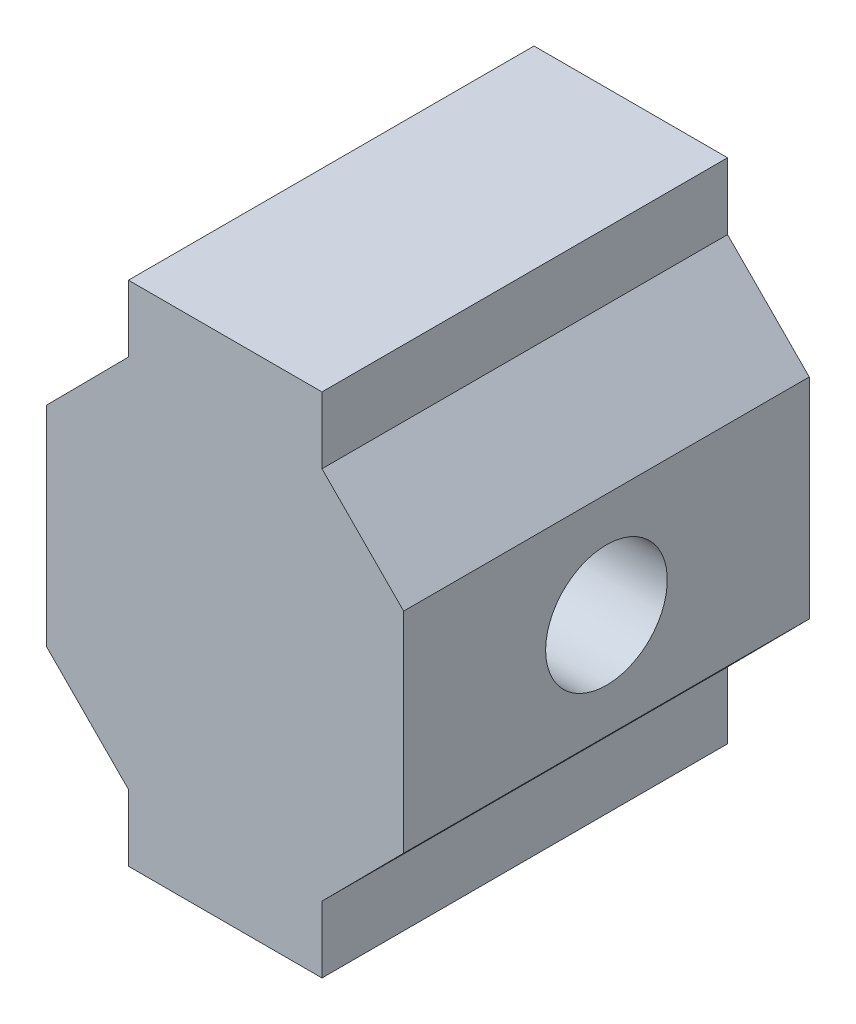
ISO-10303-21;
HEADER;
FILE_DESCRIPTION(('STEP AP214'),'2;1');
FILE_NAME('part.step','',(''),(''),'','','');
FILE_SCHEMA(('AUTOMOTIVE_DESIGN { 1 0 10303 214 1 1 1 1 }'));
ENDSEC;
DATA;
#1=APPLICATION_CONTEXT('core data for automotive mechanical design processes');
#2=APPLICATION_PROTOCOL_DEFINITION('international standard','automotive_design',2000,#1);
#3=PRODUCT_CONTEXT('',#1,'mechanical');
#4=PRODUCT('Part','Part','',(#3));
#5=PRODUCT_RELATED_PRODUCT_CATEGORY('part','',(#4));
#6=PRODUCT_DEFINITION_FORMATION('','',#4);
#7=PRODUCT_DEFINITION_CONTEXT('part definition',#1,'design');
#8=PRODUCT_DEFINITION('design','',#6,#7);
#9=PRODUCT_DEFINITION_SHAPE('','',#8);
#10=(LENGTH_UNIT() NAMED_UNIT(*) SI_UNIT(.MILLI.,.METRE.));
#11=(NAMED_UNIT(*) PLANE_ANGLE_UNIT() SI_UNIT($,.RADIAN.));
#12=(NAMED_UNIT(*) SI_UNIT($,.STERADIAN.) SOLID_ANGLE_UNIT());
#13=UNCERTAINTY_MEASURE_WITH_UNIT(LENGTH_MEASURE(1.E-05),#10,'distance_accuracy_value','');
#14=(GEOMETRIC_REPRESENTATION_CONTEXT(3) GLOBAL_UNCERTAINTY_ASSIGNED_CONTEXT((#13)) GLOBAL_UNIT_ASSIGNED_CONTEXT((#10,
#11,#12)) REPRESENTATION_CONTEXT('',''));
#15=CARTESIAN_POINT('',(0.,0.,0.));
#16=DIRECTION('',(0.,0.,1.));
#17=DIRECTION('',(1.,0.,0.));
#18=AXIS2_PLACEMENT_3D('',#15,#16,#17);
#19=CARTESIAN_POINT('',(4.772,-12.514,20.));
#20=DIRECTION('',(0.,1.,0.));
#21=DIRECTION('',(0.,0.,1.));
#22=AXIS2_PLACEMENT_3D('',#19,#20,#21);
#23=PLANE('',#22);
#24=DIRECTION('',(1.,0.,0.));
#25=VECTOR('',#24,1.);
#26=CARTESIAN_POINT('',(4.772,-12.514,0.));
#27=LINE('',#26,#25);
#28=CARTESIAN_POINT('',(-4.772,-12.514,0.));
#29=VERTEX_POINT('',#28);
#30=CARTESIAN_POINT('',(4.772,-12.514,0.));
#31=VERTEX_POINT('',#30);
#32=EDGE_CURVE('E157',#29,#31,#27,.T.);
#33=ORIENTED_EDGE('',*,*,#32,.T.);
#34=DIRECTION('',(0.,0.,-1.));
#35=VECTOR('',#34,1.);
#36=CARTESIAN_POINT('',(4.772,-12.514,20.));
#37=LINE('',#36,#35);
#38=CARTESIAN_POINT('',(4.772,-12.514,20.));
#39=VERTEX_POINT('',#38);
#40=EDGE_CURVE('E11',#39,#31,#37,.T.);
#41=ORIENTED_EDGE('',*,*,#40,.F.);
#42=DIRECTION('',(1.,0.,0.));
#43=VECTOR('',#42,1.);
#44=CARTESIAN_POINT('',(4.772,-12.514,20.));
#45=LINE('',#44,#43);
#46=CARTESIAN_POINT('',(-4.772,-12.514,20.));
#47=VERTEX_POINT('',#46);
#48=EDGE_CURVE('E182',#47,#39,#45,.T.);
#49=ORIENTED_EDGE('',*,*,#48,.F.);
#50=DIRECTION('',(0.,0.,-1.));
#51=VECTOR('',#50,1.);
#52=CARTESIAN_POINT('',(-4.772,-12.514,20.));
#53=LINE('',#52,#51);
#54=EDGE_CURVE('E153',#47,#29,#53,.T.);
#55=ORIENTED_EDGE('',*,*,#54,.T.);
#56=EDGE_LOOP('',(#33,#41,#49,#55));
#57=FACE_BOUND('',#56,.T.);
#58=ADVANCED_FACE('F37',(#57),#23,.F.);
#59=CARTESIAN_POINT('',(4.772,-12.514,20.));
#60=DIRECTION('',(-1.,0.,0.));
#61=DIRECTION('',(0.,0.,1.));
#62=AXIS2_PLACEMENT_3D('',#59,#60,#61);
#63=PLANE('',#62);
#64=DIRECTION('',(0.,1.,0.));
#65=VECTOR('',#64,1.);
#66=CARTESIAN_POINT('',(4.772,-12.514,0.));
#67=LINE('',#66,#65);
#68=CARTESIAN_POINT('',(4.772,-9.23167801898961,0.));
#69=VERTEX_POINT('',#68);
#70=EDGE_CURVE('E160',#31,#69,#67,.T.);
#71=ORIENTED_EDGE('',*,*,#70,.T.);
#72=DIRECTION('',(0.,0.,-1.));
#73=VECTOR('',#72,1.);
#74=CARTESIAN_POINT('',(4.772,-9.23167801898961,20.));
#75=LINE('',#74,#73);
#76=CARTESIAN_POINT('',(4.772,-9.23167801898961,20.));
#77=VERTEX_POINT('',#76);
#78=EDGE_CURVE('E46',#77,#69,#75,.T.);
#79=ORIENTED_EDGE('',*,*,#78,.F.);
#80=DIRECTION('',(0.,1.,0.));
#81=VECTOR('',#80,1.);
#82=CARTESIAN_POINT('',(4.772,-12.514,20.));
#83=LINE('',#82,#81);
#84=EDGE_CURVE('E109',#39,#77,#83,.T.);
#85=ORIENTED_EDGE('',*,*,#84,.F.);
#86=ORIENTED_EDGE('',*,*,#40,.T.);
#87=EDGE_LOOP('',(#71,#79,#85,#86));
#88=FACE_BOUND('',#87,.T.);
#89=ADVANCED_FACE('F261',(#88),#63,.F.);
#90=CARTESIAN_POINT('',(4.772,-9.23167801898961,20.));
#91=DIRECTION('',(-0.710245556345468,0.70395401106288,0.));
#92=DIRECTION('',(-0.70395401106288,-0.710245556345468,0.));
#93=AXIS2_PLACEMENT_3D('',#90,#91,#92);
#94=PLANE('',#93);
#95=DIRECTION('',(0.70395401106288,0.710245556345468,0.));
#96=VECTOR('',#95,1.);
#97=CARTESIAN_POINT('',(4.772,-9.23167801898961,0.));
#98=LINE('',#97,#96);
#99=CARTESIAN_POINT('',(8.8,-5.16767801898961,0.));
#100=VERTEX_POINT('',#99);
#101=EDGE_CURVE('E163',#69,#100,#98,.T.);
#102=ORIENTED_EDGE('',*,*,#101,.T.);
#103=DIRECTION('',(0.,0.,-1.));
#104=VECTOR('',#103,1.);
#105=CARTESIAN_POINT('',(8.8,-5.16767801898961,20.));
#106=LINE('',#105,#104);
#107=CARTESIAN_POINT('',(8.8,-5.16767801898961,20.));
#108=VERTEX_POINT('',#107);
#109=EDGE_CURVE('E201',#108,#100,#106,.T.);
#110=ORIENTED_EDGE('',*,*,#109,.F.);
#111=DIRECTION('',(0.70395401106288,0.710245556345468,0.));
#112=VECTOR('',#111,1.);
#113=CARTESIAN_POINT('',(4.772,-9.23167801898961,20.));
#114=LINE('',#113,#112);
#115=EDGE_CURVE('E210',#77,#108,#114,.T.);
#116=ORIENTED_EDGE('',*,*,#115,.F.);
#117=ORIENTED_EDGE('',*,*,#78,.T.);
#118=EDGE_LOOP('',(#102,#110,#116,#117));
#119=FACE_BOUND('',#118,.T.);
#120=ADVANCED_FACE('F208',(#119),#94,.F.);
#121=CARTESIAN_POINT('',(8.8,0.,20.));
#122=DIRECTION('',(-1.,0.,0.));
#123=DIRECTION('',(0.,0.,1.));
#124=AXIS2_PLACEMENT_3D('',#121,#122,#123);
#125=PLANE('',#124);
#126=CARTESIAN_POINT('',(8.8,0.,10.));
#127=DIRECTION('',(-1.,0.,0.));
#128=DIRECTION('',(0.,0.,1.));
#129=AXIS2_PLACEMENT_3D('',#126,#127,#128);
#130=CIRCLE('',#129,3.);
#131=CARTESIAN_POINT('',(8.8,0.,13.));
#132=VERTEX_POINT('',#131);
#133=EDGE_CURVE('E161',#132,#132,#130,.F.);
#134=ORIENTED_EDGE('',*,*,#133,.F.);
#135=EDGE_LOOP('',(#134));
#136=FACE_BOUND('',#135,.T.);
#137=DIRECTION('',(0.,1.,0.));
#138=VECTOR('',#137,1.);
#139=CARTESIAN_POINT('',(8.8,0.,0.));
#140=LINE('',#139,#138);
#141=CARTESIAN_POINT('',(8.8,5.16767801898961,0.));
#142=VERTEX_POINT('',#141);
#143=EDGE_CURVE('E166',#100,#142,#140,.T.);
#144=ORIENTED_EDGE('',*,*,#143,.T.);
#145=DIRECTION('',(0.,0.,-1.));
#146=VECTOR('',#145,1.);
#147=CARTESIAN_POINT('',(8.8,5.16767801898961,20.));
#148=LINE('',#147,#146);
#149=CARTESIAN_POINT('',(8.8,5.16767801898961,20.));
#150=VERTEX_POINT('',#149);
#151=EDGE_CURVE('E198',#150,#142,#148,.T.);
#152=ORIENTED_EDGE('',*,*,#151,.F.);
#153=DIRECTION('',(0.,1.,0.));
#154=VECTOR('',#153,1.);
#155=CARTESIAN_POINT('',(8.8,0.,20.));
#156=LINE('',#155,#154);
#157=EDGE_CURVE('E227',#108,#150,#156,.T.);
#158=ORIENTED_EDGE('',*,*,#157,.F.);
#159=ORIENTED_EDGE('',*,*,#109,.T.);
#160=EDGE_LOOP('',(#144,#152,#158,#159));
#161=FACE_BOUND('',#160,.T.);
#162=ADVANCED_FACE('F218',(#136,#161),#125,.F.);
#163=CARTESIAN_POINT('',(4.772,9.23167801898962,20.));
#164=DIRECTION('',(-0.710245556345468,-0.703954011062879,0.));
#165=DIRECTION('',(0.703954011062879,-0.710245556345468,0.));
#166=AXIS2_PLACEMENT_3D('',#163,#164,#165);
#167=PLANE('',#166);
#168=DIRECTION('',(-0.703954011062879,0.710245556345468,0.));
#169=VECTOR('',#168,1.);
#170=CARTESIAN_POINT('',(4.772,9.23167801898962,0.));
#171=LINE('',#170,#169);
#172=CARTESIAN_POINT('',(4.772,9.23167801898962,0.));
#173=VERTEX_POINT('',#172);
#174=EDGE_CURVE('E168',#142,#173,#171,.T.);
#175=ORIENTED_EDGE('',*,*,#174,.T.);
#176=DIRECTION('',(0.,0.,-1.));
#177=VECTOR('',#176,1.);
#178=CARTESIAN_POINT('',(4.772,9.23167801898962,20.));
#179=LINE('',#178,#177);
#180=CARTESIAN_POINT('',(4.772,9.23167801898962,20.));
#181=VERTEX_POINT('',#180);
#182=EDGE_CURVE('E195',#181,#173,#179,.T.);
#183=ORIENTED_EDGE('',*,*,#182,.F.);
#184=DIRECTION('',(-0.703954011062879,0.710245556345468,0.));
#185=VECTOR('',#184,1.);
#186=CARTESIAN_POINT('',(4.772,9.23167801898962,20.));
#187=LINE('',#186,#185);
#188=EDGE_CURVE('E224',#150,#181,#187,.T.);
#189=ORIENTED_EDGE('',*,*,#188,.F.);
#190=ORIENTED_EDGE('',*,*,#151,.T.);
#191=EDGE_LOOP('',(#175,#183,#189,#190));
#192=FACE_BOUND('',#191,.T.);
#193=ADVANCED_FACE('F222',(#192),#167,.F.);
#194=CARTESIAN_POINT('',(4.772,12.514,20.));
#195=DIRECTION('',(-1.,0.,0.));
#196=DIRECTION('',(0.,0.,1.));
#197=AXIS2_PLACEMENT_3D('',#194,#195,#196);
#198=PLANE('',#197);
#199=DIRECTION('',(0.,1.,0.));
#200=VECTOR('',#199,1.);
#201=CARTESIAN_POINT('',(4.772,12.514,0.));
#202=LINE('',#201,#200);
#203=CARTESIAN_POINT('',(4.772,12.514,0.));
#204=VERTEX_POINT('',#203);
#205=EDGE_CURVE('E170',#173,#204,#202,.T.);
#206=ORIENTED_EDGE('',*,*,#205,.T.);
#207=DIRECTION('',(0.,0.,-1.));
#208=VECTOR('',#207,1.);
#209=CARTESIAN_POINT('',(4.772,12.514,20.));
#210=LINE('',#209,#208);
#211=CARTESIAN_POINT('',(4.772,12.514,20.));
#212=VERTEX_POINT('',#211);
#213=EDGE_CURVE('E192',#212,#204,#210,.T.);
#214=ORIENTED_EDGE('',*,*,#213,.F.);
#215=DIRECTION('',(0.,1.,0.));
#216=VECTOR('',#215,1.);
#217=CARTESIAN_POINT('',(4.772,12.514,20.));
#218=LINE('',#217,#216);
#219=EDGE_CURVE('E226',#181,#212,#218,.T.);
#220=ORIENTED_EDGE('',*,*,#219,.F.);
#221=ORIENTED_EDGE('',*,*,#182,.T.);
#222=EDGE_LOOP('',(#206,#214,#220,#221));
#223=FACE_BOUND('',#222,.T.);
#224=ADVANCED_FACE('F275',(#223),#198,.F.);
#225=CARTESIAN_POINT('',(4.772,12.514,20.));
#226=DIRECTION('',(0.,-1.,0.));
#227=DIRECTION('',(0.,0.,-1.));
#228=AXIS2_PLACEMENT_3D('',#225,#226,#227);
#229=PLANE('',#228);
#230=DIRECTION('',(-1.,0.,0.));
#231=VECTOR('',#230,1.);
#232=CARTESIAN_POINT('',(4.772,12.514,0.));
#233=LINE('',#232,#231);
#234=CARTESIAN_POINT('',(-4.772,12.514,0.));
#235=VERTEX_POINT('',#234);
#236=EDGE_CURVE('E172',#204,#235,#233,.T.);
#237=ORIENTED_EDGE('',*,*,#236,.T.);
#238=DIRECTION('',(0.,0.,-1.));
#239=VECTOR('',#238,1.);
#240=CARTESIAN_POINT('',(-4.772,12.514,20.));
#241=LINE('',#240,#239);
#242=CARTESIAN_POINT('',(-4.772,12.514,20.));
#243=VERTEX_POINT('',#242);
#244=EDGE_CURVE('E189',#243,#235,#241,.T.);
#245=ORIENTED_EDGE('',*,*,#244,.F.);
#246=DIRECTION('',(-1.,0.,0.));
#247=VECTOR('',#246,1.);
#248=CARTESIAN_POINT('',(4.772,12.514,20.));
#249=LINE('',#248,#247);
#250=EDGE_CURVE('E229',#212,#243,#249,.T.);
#251=ORIENTED_EDGE('',*,*,#250,.F.);
#252=ORIENTED_EDGE('',*,*,#213,.T.);
#253=EDGE_LOOP('',(#237,#245,#251,#252));
#254=FACE_BOUND('',#253,.T.);
#255=ADVANCED_FACE('F278',(#254),#229,.F.);
#256=CARTESIAN_POINT('',(-4.772,12.514,20.));
#257=DIRECTION('',(1.,0.,0.));
#258=DIRECTION('',(0.,0.,-1.));
#259=AXIS2_PLACEMENT_3D('',#256,#257,#258);
#260=PLANE('',#259);
#261=DIRECTION('',(0.,-1.,0.));
#262=VECTOR('',#261,1.);
#263=CARTESIAN_POINT('',(-4.772,12.514,0.));
#264=LINE('',#263,#262);
#265=CARTESIAN_POINT('',(-4.772,9.23167801898962,0.));
#266=VERTEX_POINT('',#265);
#267=EDGE_CURVE('E174',#235,#266,#264,.T.);
#268=ORIENTED_EDGE('',*,*,#267,.T.);
#269=DIRECTION('',(0.,0.,-1.));
#270=VECTOR('',#269,1.);
#271=CARTESIAN_POINT('',(-4.772,9.23167801898962,20.));
#272=LINE('',#271,#270);
#273=CARTESIAN_POINT('',(-4.772,9.23167801898962,20.));
#274=VERTEX_POINT('',#273);
#275=EDGE_CURVE('E186',#274,#266,#272,.T.);
#276=ORIENTED_EDGE('',*,*,#275,.F.);
#277=DIRECTION('',(0.,-1.,0.));
#278=VECTOR('',#277,1.);
#279=CARTESIAN_POINT('',(-4.772,12.514,20.));
#280=LINE('',#279,#278);
#281=EDGE_CURVE('E235',#243,#274,#280,.T.);
#282=ORIENTED_EDGE('',*,*,#281,.F.);
#283=ORIENTED_EDGE('',*,*,#244,.T.);
#284=EDGE_LOOP('',(#268,#276,#282,#283));
#285=FACE_BOUND('',#284,.T.);
#286=ADVANCED_FACE('F241',(#285),#260,.F.);
#287=CARTESIAN_POINT('',(-4.772,9.23167801898962,20.));
#288=DIRECTION('',(0.710245556345468,-0.703954011062879,0.));
#289=DIRECTION('',(0.703954011062879,0.710245556345468,0.));
#290=AXIS2_PLACEMENT_3D('',#287,#288,#289);
#291=PLANE('',#290);
#292=DIRECTION('',(-0.703954011062879,-0.710245556345468,0.));
#293=VECTOR('',#292,1.);
#294=CARTESIAN_POINT('',(-4.772,9.23167801898962,0.));
#295=LINE('',#294,#293);
#296=CARTESIAN_POINT('',(-8.8,5.16767801898961,0.));
#297=VERTEX_POINT('',#296);
#298=EDGE_CURVE('E176',#266,#297,#295,.T.);
#299=ORIENTED_EDGE('',*,*,#298,.T.);
#300=DIRECTION('',(0.,0.,-1.));
#301=VECTOR('',#300,1.);
#302=CARTESIAN_POINT('',(-8.8,5.16767801898961,20.));
#303=LINE('',#302,#301);
#304=CARTESIAN_POINT('',(-8.8,5.16767801898961,20.));
#305=VERTEX_POINT('',#304);
#306=EDGE_CURVE('E148',#305,#297,#303,.T.);
#307=ORIENTED_EDGE('',*,*,#306,.F.);
#308=DIRECTION('',(-0.703954011062879,-0.710245556345468,0.));
#309=VECTOR('',#308,1.);
#310=CARTESIAN_POINT('',(-4.772,9.23167801898962,20.));
#311=LINE('',#310,#309);
#312=EDGE_CURVE('E140',#274,#305,#311,.T.);
#313=ORIENTED_EDGE('',*,*,#312,.F.);
#314=ORIENTED_EDGE('',*,*,#275,.T.);
#315=EDGE_LOOP('',(#299,#307,#313,#314));
#316=FACE_BOUND('',#315,.T.);
#317=ADVANCED_FACE('F245',(#316),#291,.F.);
#318=CARTESIAN_POINT('',(-8.8,0.,20.));
#319=DIRECTION('',(1.,0.,0.));
#320=DIRECTION('',(0.,0.,-1.));
#321=AXIS2_PLACEMENT_3D('',#318,#319,#320);
#322=PLANE('',#321);
#323=CARTESIAN_POINT('',(-8.8,0.,10.));
#324=DIRECTION('',(1.,0.,0.));
#325=DIRECTION('',(0.,0.,-1.));
#326=AXIS2_PLACEMENT_3D('',#323,#324,#325);
#327=CIRCLE('',#326,3.);
#328=CARTESIAN_POINT('',(-8.8,0.,7.));
#329=VERTEX_POINT('',#328);
#330=EDGE_CURVE('E40',#329,#329,#327,.F.);
#331=ORIENTED_EDGE('',*,*,#330,.F.);
#332=EDGE_LOOP('',(#331));
#333=FACE_BOUND('',#332,.T.);
#334=DIRECTION('',(0.,-1.,0.));
#335=VECTOR('',#334,1.);
#336=CARTESIAN_POINT('',(-8.8,0.,0.));
#337=LINE('',#336,#335);
#338=CARTESIAN_POINT('',(-8.8,-5.16767801898961,0.));
#339=VERTEX_POINT('',#338);
#340=EDGE_CURVE('E147',#297,#339,#337,.T.);
#341=ORIENTED_EDGE('',*,*,#340,.T.);
#342=DIRECTION('',(0.,0.,-1.));
#343=VECTOR('',#342,1.);
#344=CARTESIAN_POINT('',(-8.8,-5.16767801898961,20.));
#345=LINE('',#344,#343);
#346=CARTESIAN_POINT('',(-8.8,-5.16767801898961,20.));
#347=VERTEX_POINT('',#346);
#348=EDGE_CURVE('E145',#347,#339,#345,.T.);
#349=ORIENTED_EDGE('',*,*,#348,.F.);
#350=DIRECTION('',(0.,-1.,0.));
#351=VECTOR('',#350,1.);
#352=CARTESIAN_POINT('',(-8.8,0.,20.));
#353=LINE('',#352,#351);
#354=EDGE_CURVE('E134',#305,#347,#353,.T.);
#355=ORIENTED_EDGE('',*,*,#354,.F.);
#356=ORIENTED_EDGE('',*,*,#306,.T.);
#357=EDGE_LOOP('',(#341,#349,#355,#356));
#358=FACE_BOUND('',#357,.T.);
#359=ADVANCED_FACE('F146',(#333,#358),#322,.F.);
#360=CARTESIAN_POINT('',(-4.772,-9.23167801898961,20.));
#361=DIRECTION('',(0.710245556345468,0.70395401106288,0.));
#362=DIRECTION('',(-0.70395401106288,0.710245556345468,0.));
#363=AXIS2_PLACEMENT_3D('',#360,#361,#362);
#364=PLANE('',#363);
#365=DIRECTION('',(0.70395401106288,-0.710245556345468,0.));
#366=VECTOR('',#365,1.);
#367=CARTESIAN_POINT('',(-4.772,-9.23167801898961,0.));
#368=LINE('',#367,#366);
#369=CARTESIAN_POINT('',(-4.772,-9.23167801898961,0.));
#370=VERTEX_POINT('',#369);
#371=EDGE_CURVE('E95',#339,#370,#368,.T.);
#372=ORIENTED_EDGE('',*,*,#371,.T.);
#373=DIRECTION('',(0.,0.,-1.));
#374=VECTOR('',#373,1.);
#375=CARTESIAN_POINT('',(-4.772,-9.23167801898961,20.));
#376=LINE('',#375,#374);
#377=CARTESIAN_POINT('',(-4.772,-9.23167801898961,20.));
#378=VERTEX_POINT('',#377);
#379=EDGE_CURVE('E149',#378,#370,#376,.T.);
#380=ORIENTED_EDGE('',*,*,#379,.F.);
#381=DIRECTION('',(0.70395401106288,-0.710245556345468,0.));
#382=VECTOR('',#381,1.);
#383=CARTESIAN_POINT('',(-4.772,-9.23167801898961,20.));
#384=LINE('',#383,#382);
#385=EDGE_CURVE('E138',#347,#378,#384,.T.);
#386=ORIENTED_EDGE('',*,*,#385,.F.);
#387=ORIENTED_EDGE('',*,*,#348,.T.);
#388=EDGE_LOOP('',(#372,#380,#386,#387));
#389=FACE_BOUND('',#388,.T.);
#390=ADVANCED_FACE('F151',(#389),#364,.F.);
#391=CARTESIAN_POINT('',(-4.772,-12.514,20.));
#392=DIRECTION('',(1.,0.,0.));
#393=DIRECTION('',(0.,0.,-1.));
#394=AXIS2_PLACEMENT_3D('',#391,#392,#393);
#395=PLANE('',#394);
#396=DIRECTION('',(0.,-1.,0.));
#397=VECTOR('',#396,1.);
#398=CARTESIAN_POINT('',(-4.772,-12.514,0.));
#399=LINE('',#398,#397);
#400=EDGE_CURVE('E101',#370,#29,#399,.T.);
#401=ORIENTED_EDGE('',*,*,#400,.T.);
#402=ORIENTED_EDGE('',*,*,#54,.F.);
#403=DIRECTION('',(0.,-1.,0.));
#404=VECTOR('',#403,1.);
#405=CARTESIAN_POINT('',(-4.772,-12.514,20.));
#406=LINE('',#405,#404);
#407=EDGE_CURVE('E54',#378,#47,#406,.T.);
#408=ORIENTED_EDGE('',*,*,#407,.F.);
#409=ORIENTED_EDGE('',*,*,#379,.T.);
#410=EDGE_LOOP('',(#401,#402,#408,#409));
#411=FACE_BOUND('',#410,.T.);
#412=ADVANCED_FACE('F250',(#411),#395,.F.);
#413=CARTESIAN_POINT('',(0.,0.,20.));
#414=DIRECTION('',(0.,0.,-1.));
#415=DIRECTION('',(-1.,0.,0.));
#416=AXIS2_PLACEMENT_3D('',#413,#414,#415);
#417=PLANE('',#416);
#418=ORIENTED_EDGE('',*,*,#48,.T.);
#419=ORIENTED_EDGE('',*,*,#84,.T.);
#420=ORIENTED_EDGE('',*,*,#115,.T.);
#421=ORIENTED_EDGE('',*,*,#157,.T.);
#422=ORIENTED_EDGE('',*,*,#188,.T.);
#423=ORIENTED_EDGE('',*,*,#219,.T.);
#424=ORIENTED_EDGE('',*,*,#250,.T.);
#425=ORIENTED_EDGE('',*,*,#281,.T.);
#426=ORIENTED_EDGE('',*,*,#312,.T.);
#427=ORIENTED_EDGE('',*,*,#354,.T.);
#428=ORIENTED_EDGE('',*,*,#385,.T.);
#429=ORIENTED_EDGE('',*,*,#407,.T.);
#430=EDGE_LOOP('',(#418,#419,#420,#421,#422,#423,#424,#425,#426,#427,#428,#429));
#431=FACE_BOUND('',#430,.T.);
#432=ADVANCED_FACE('F136',(#431),#417,.F.);
#433=CARTESIAN_POINT('',(0.,0.,0.));
#434=DIRECTION('',(0.,0.,-1.));
#435=DIRECTION('',(-1.,0.,0.));
#436=AXIS2_PLACEMENT_3D('',#433,#434,#435);
#437=PLANE('',#436);
#438=CARTESIAN_POINT('',(0.,0.,0.));
#439=DIRECTION('',(0.,0.,-1.));
#440=DIRECTION('',(-1.,0.,0.));
#441=AXIS2_PLACEMENT_3D('',#438,#439,#440);
#442=CIRCLE('',#441,1.95);
#443=CARTESIAN_POINT('',(-1.95,0.,0.));
#444=VERTEX_POINT('',#443);
#445=EDGE_CURVE('E298',#444,#444,#442,.T.);
#446=ORIENTED_EDGE('',*,*,#445,.F.);
#447=EDGE_LOOP('',(#446));
#448=FACE_BOUND('',#447,.T.);
#449=ORIENTED_EDGE('',*,*,#32,.F.);
#450=ORIENTED_EDGE('',*,*,#400,.F.);
#451=ORIENTED_EDGE('',*,*,#371,.F.);
#452=ORIENTED_EDGE('',*,*,#340,.F.);
#453=ORIENTED_EDGE('',*,*,#298,.F.);
#454=ORIENTED_EDGE('',*,*,#267,.F.);
#455=ORIENTED_EDGE('',*,*,#236,.F.);
#456=ORIENTED_EDGE('',*,*,#205,.F.);
#457=ORIENTED_EDGE('',*,*,#174,.F.);
#458=ORIENTED_EDGE('',*,*,#143,.F.);
#459=ORIENTED_EDGE('',*,*,#101,.F.);
#460=ORIENTED_EDGE('',*,*,#70,.F.);
#461=EDGE_LOOP('',(#449,#450,#451,#452,#453,#454,#455,#456,#457,#458,#459,#460));
#462=FACE_BOUND('',#461,.T.);
#463=ADVANCED_FACE('F213',(#448,#462),#437,.T.);
#464=CARTESIAN_POINT('',(20.,0.,10.));
#465=DIRECTION('',(-1.,0.,0.));
#466=DIRECTION('',(0.,0.,1.));
#467=AXIS2_PLACEMENT_3D('',#464,#465,#466);
#468=CYLINDRICAL_SURFACE('',#467,3.);
#469=ORIENTED_EDGE('',*,*,#330,.T.);
#470=EDGE_LOOP('',(#469));
#471=FACE_BOUND('',#470,.T.);
#472=ORIENTED_EDGE('',*,*,#133,.T.);
#473=EDGE_LOOP('',(#472));
#474=FACE_BOUND('',#473,.T.);
#475=ADVANCED_FACE('F311',(#471,#474),#468,.F.);
#476=CARTESIAN_POINT('',(0.,0.,6.));
#477=DIRECTION('',(0.,0.,-1.));
#478=DIRECTION('',(-1.,0.,0.));
#479=AXIS2_PLACEMENT_3D('',#476,#477,#478);
#480=CYLINDRICAL_SURFACE('',#479,1.95);
#481=CARTESIAN_POINT('',(0.,0.,6.));
#482=DIRECTION('',(0.,0.,-1.));
#483=DIRECTION('',(-1.,0.,0.));
#484=AXIS2_PLACEMENT_3D('',#481,#482,#483);
#485=CIRCLE('',#484,1.95);
#486=CARTESIAN_POINT('',(-1.95,0.,6.));
#487=VERTEX_POINT('',#486);
#488=EDGE_CURVE('E294',#487,#487,#485,.T.);
#489=ORIENTED_EDGE('',*,*,#488,.F.);
#490=EDGE_LOOP('',(#489));
#491=FACE_BOUND('',#490,.T.);
#492=ORIENTED_EDGE('',*,*,#445,.T.);
#493=EDGE_LOOP('',(#492));
#494=FACE_BOUND('',#493,.T.);
#495=ADVANCED_FACE('F308',(#491,#494),#480,.F.);
#496=CARTESIAN_POINT('',(0.,0.,6.));
#497=DIRECTION('',(0.,0.,-1.));
#498=DIRECTION('',(-1.,0.,0.));
#499=AXIS2_PLACEMENT_3D('',#496,#497,#498);
#500=PLANE('',#499);
#501=ORIENTED_EDGE('',*,*,#488,.T.);
#502=EDGE_LOOP('',(#501));
#503=FACE_BOUND('',#502,.T.);
#504=ADVANCED_FACE('F319',(#503),#500,.T.);
#505=CLOSED_SHELL('',(#58,#89,#120,#162,#193,#224,#255,#286,#317,#359,#390,#412,#432,#463,#475,
#495,#504));
#506=MANIFOLD_SOLID_BREP('B2',#505);
#507=ADVANCED_BREP_SHAPE_REPRESENTATION('',(#18,#506),#14);
#508=SHAPE_DEFINITION_REPRESENTATION(#9,#507);
ENDSEC;
END-ISO-10303-21;
